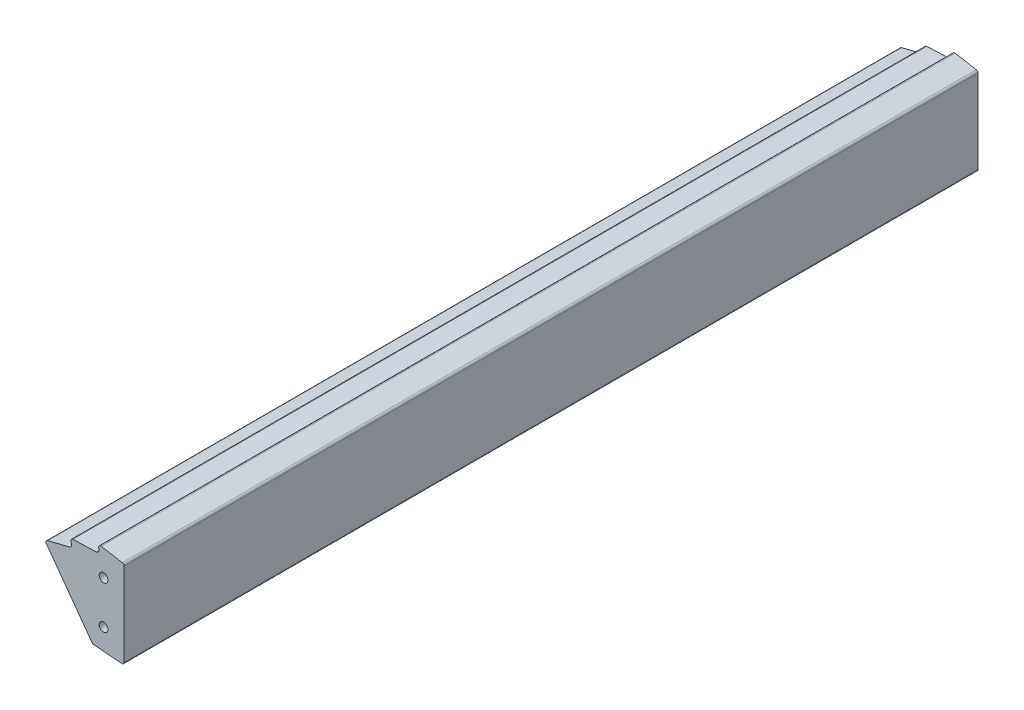
ISO-10303-21;
HEADER;
FILE_DESCRIPTION(('STEP AP214'),'2;1');
FILE_NAME('part.step','',(''),(''),'','','');
FILE_SCHEMA(('AUTOMOTIVE_DESIGN { 1 0 10303 214 1 1 1 1 }'));
ENDSEC;
DATA;
#1=APPLICATION_CONTEXT('core data for automotive mechanical design processes');
#2=APPLICATION_PROTOCOL_DEFINITION('international standard','automotive_design',2000,#1);
#3=PRODUCT_CONTEXT('',#1,'mechanical');
#4=PRODUCT('Part','Part','',(#3));
#5=PRODUCT_RELATED_PRODUCT_CATEGORY('part','',(#4));
#6=PRODUCT_DEFINITION_FORMATION('','',#4);
#7=PRODUCT_DEFINITION_CONTEXT('part definition',#1,'design');
#8=PRODUCT_DEFINITION('design','',#6,#7);
#9=PRODUCT_DEFINITION_SHAPE('','',#8);
#10=(LENGTH_UNIT() NAMED_UNIT(*) SI_UNIT(.MILLI.,.METRE.));
#11=(NAMED_UNIT(*) PLANE_ANGLE_UNIT() SI_UNIT($,.RADIAN.));
#12=(NAMED_UNIT(*) SI_UNIT($,.STERADIAN.) SOLID_ANGLE_UNIT());
#13=UNCERTAINTY_MEASURE_WITH_UNIT(LENGTH_MEASURE(1.E-05),#10,'distance_accuracy_value','');
#14=(GEOMETRIC_REPRESENTATION_CONTEXT(3) GLOBAL_UNCERTAINTY_ASSIGNED_CONTEXT((#13)) GLOBAL_UNIT_ASSIGNED_CONTEXT((#10,
#11,#12)) REPRESENTATION_CONTEXT('',''));
#15=CARTESIAN_POINT('',(0.,0.,0.));
#16=DIRECTION('',(0.,0.,1.));
#17=DIRECTION('',(1.,0.,0.));
#18=AXIS2_PLACEMENT_3D('',#15,#16,#17);
#19=CARTESIAN_POINT('',(-46.6812399998423,66.4118678141727,357.84012977767));
#20=DIRECTION('',(0.809016994374946,0.587785252292476,0.));
#21=DIRECTION('',(-0.587785252292476,0.809016994374946,0.));
#22=AXIS2_PLACEMENT_3D('',#19,#20,#21);
#23=PLANE('',#22);
#24=DIRECTION('',(0.587785252292476,-0.809016994374946,0.));
#25=VECTOR('',#24,1.);
#26=CARTESIAN_POINT('',(-46.6812399998423,66.4118678141727,212.000125));
#27=LINE('',#26,#25);
#28=CARTESIAN_POINT('',(-46.7307638488462,66.4800315445737,212.000125));
#29=VERTEX_POINT('',#28);
#30=CARTESIAN_POINT('',(-20.002598727479,29.6918683041559,212.000125));
#31=VERTEX_POINT('',#30);
#32=EDGE_CURVE('E439',#29,#31,#27,.T.);
#33=ORIENTED_EDGE('',*,*,#32,.F.);
#34=DIRECTION('',(0.,0.,-1.));
#35=VECTOR('',#34,1.);
#36=CARTESIAN_POINT('',(-46.7307638488462,66.4800315445737,357.84012977767));
#37=LINE('',#36,#35);
#38=CARTESIAN_POINT('',(-46.7307638488462,66.4800315445737,-287.999875));
#39=VERTEX_POINT('',#38);
#40=EDGE_CURVE('E441',#29,#39,#37,.T.);
#41=ORIENTED_EDGE('',*,*,#40,.T.);
#42=DIRECTION('',(-0.587785252292476,0.809016994374946,0.));
#43=VECTOR('',#42,1.);
#44=CARTESIAN_POINT('',(-46.6812399998423,66.4118678141727,-287.999875));
#45=LINE('',#44,#43);
#46=CARTESIAN_POINT('',(-20.002598727479,29.6918683041559,-287.999875));
#47=VERTEX_POINT('',#46);
#48=EDGE_CURVE('E243',#47,#39,#45,.T.);
#49=ORIENTED_EDGE('',*,*,#48,.F.);
#50=DIRECTION('',(0.,0.,-1.));
#51=VECTOR('',#50,1.);
#52=CARTESIAN_POINT('',(-20.002598727479,29.6918683041559,357.84012977767));
#53=LINE('',#52,#51);
#54=EDGE_CURVE('E442',#31,#47,#53,.T.);
#55=ORIENTED_EDGE('',*,*,#54,.F.);
#56=EDGE_LOOP('',(#33,#41,#49,#55));
#57=FACE_BOUND('',#56,.T.);
#58=ADVANCED_FACE('F229',(#57),#23,.F.);
#59=CARTESIAN_POINT('',(-19.0075078243978,30.4148441644756,357.84012977767));
#60=DIRECTION('',(0.,0.,-1.));
#61=DIRECTION('',(-1.,0.,0.));
#62=AXIS2_PLACEMENT_3D('',#59,#60,#61);
#63=CYLINDRICAL_SURFACE('',#62,1.23);
#64=CARTESIAN_POINT('',(-19.0075078243978,30.4148441644756,212.000125));
#65=DIRECTION('',(0.,0.,1.));
#66=DIRECTION('',(1.,0.,0.));
#67=AXIS2_PLACEMENT_3D('',#64,#65,#66);
#68=CIRCLE('',#67,1.23);
#69=CARTESIAN_POINT('',(-19.1053703077178,29.1887434612875,212.000125));
#70=VERTEX_POINT('',#69);
#71=EDGE_CURVE('E437',#31,#70,#68,.T.);
#72=ORIENTED_EDGE('',*,*,#71,.F.);
#73=ORIENTED_EDGE('',*,*,#54,.T.);
#74=CARTESIAN_POINT('',(-19.0075078243978,30.4148441644756,-287.999875));
#75=DIRECTION('',(0.,0.,-1.));
#76=DIRECTION('',(-1.,0.,0.));
#77=AXIS2_PLACEMENT_3D('',#74,#75,#76);
#78=CIRCLE('',#77,1.23);
#79=CARTESIAN_POINT('',(-19.1053703077178,29.1887434612875,-287.999875));
#80=VERTEX_POINT('',#79);
#81=EDGE_CURVE('E409',#80,#47,#78,.T.);
#82=ORIENTED_EDGE('',*,*,#81,.F.);
#83=DIRECTION('',(0.,0.,-1.));
#84=VECTOR('',#83,1.);
#85=CARTESIAN_POINT('',(-19.1053703077178,29.1887434612875,357.84012977767));
#86=LINE('',#85,#84);
#87=EDGE_CURVE('E445',#70,#80,#86,.T.);
#88=ORIENTED_EDGE('',*,*,#87,.F.);
#89=EDGE_LOOP('',(#72,#73,#82,#88));
#90=FACE_BOUND('',#89,.T.);
#91=ADVANCED_FACE('F505',(#90),#63,.T.);
#92=CARTESIAN_POINT('',(-19.1053703077178,29.1887434612875,357.84012977767));
#93=DIRECTION('',(0.0795629945691547,0.996829839990351,0.));
#94=DIRECTION('',(-0.996829839990351,0.0795629945691548,0.));
#95=AXIS2_PLACEMENT_3D('',#92,#93,#94);
#96=PLANE('',#95);
#97=DIRECTION('',(0.996829839990351,-0.0795629945691548,0.));
#98=VECTOR('',#97,1.);
#99=CARTESIAN_POINT('',(-19.1053703077178,29.1887434612875,212.000125));
#100=LINE('',#99,#98);
#101=CARTESIAN_POINT('',(-2.59786248331995,27.8711798183336,212.000125));
#102=VERTEX_POINT('',#101);
#103=EDGE_CURVE('E435',#70,#102,#100,.T.);
#104=ORIENTED_EDGE('',*,*,#103,.F.);
#105=ORIENTED_EDGE('',*,*,#87,.T.);
#106=DIRECTION('',(-0.996829839990351,0.0795629945691548,0.));
#107=VECTOR('',#106,1.);
#108=CARTESIAN_POINT('',(-19.1053703077178,29.1887434612875,-287.999875));
#109=LINE('',#108,#107);
#110=CARTESIAN_POINT('',(-2.59786248331995,27.8711798183336,-287.999875));
#111=VERTEX_POINT('',#110);
#112=EDGE_CURVE('E407',#111,#80,#109,.T.);
#113=ORIENTED_EDGE('',*,*,#112,.F.);
#114=DIRECTION('',(0.,0.,-1.));
#115=VECTOR('',#114,1.);
#116=CARTESIAN_POINT('',(-2.59786248331995,27.8711798183336,357.84012977767));
#117=LINE('',#116,#115);
#118=EDGE_CURVE('E448',#102,#111,#117,.T.);
#119=ORIENTED_EDGE('',*,*,#118,.F.);
#120=EDGE_LOOP('',(#104,#105,#113,#119));
#121=FACE_BOUND('',#120,.T.);
#122=ADVANCED_FACE('F511',(#121),#96,.F.);
#123=CARTESIAN_POINT('',(-2.49999999999989,29.0972805215217,357.84012977767));
#124=DIRECTION('',(0.,0.,-1.));
#125=DIRECTION('',(-1.,0.,0.));
#126=AXIS2_PLACEMENT_3D('',#123,#124,#125);
#127=CYLINDRICAL_SURFACE('',#126,1.23);
#128=CARTESIAN_POINT('',(-2.49999999999989,29.0972805215217,212.000125));
#129=DIRECTION('',(0.,0.,1.));
#130=DIRECTION('',(1.,0.,0.));
#131=AXIS2_PLACEMENT_3D('',#128,#129,#130);
#132=CIRCLE('',#131,1.23);
#133=CARTESIAN_POINT('',(-1.26999999999993,29.0972805215217,212.000125));
#134=VERTEX_POINT('',#133);
#135=EDGE_CURVE('E433',#102,#134,#132,.T.);
#136=ORIENTED_EDGE('',*,*,#135,.F.);
#137=ORIENTED_EDGE('',*,*,#118,.T.);
#138=CARTESIAN_POINT('',(-2.49999999999989,29.0972805215217,-287.999875));
#139=DIRECTION('',(0.,0.,-1.));
#140=DIRECTION('',(-1.,0.,0.));
#141=AXIS2_PLACEMENT_3D('',#138,#139,#140);
#142=CIRCLE('',#141,1.23);
#143=CARTESIAN_POINT('',(-1.26999999999993,29.0972805215217,-287.999875));
#144=VERTEX_POINT('',#143);
#145=EDGE_CURVE('E405',#144,#111,#142,.T.);
#146=ORIENTED_EDGE('',*,*,#145,.F.);
#147=DIRECTION('',(0.,0.,-1.));
#148=VECTOR('',#147,1.);
#149=CARTESIAN_POINT('',(-1.26999999999989,29.0972805215217,357.84012977767));
#150=LINE('',#149,#148);
#151=EDGE_CURVE('E451',#134,#144,#150,.T.);
#152=ORIENTED_EDGE('',*,*,#151,.F.);
#153=EDGE_LOOP('',(#136,#137,#146,#152));
#154=FACE_BOUND('',#153,.T.);
#155=ADVANCED_FACE('F515',(#154),#127,.T.);
#156=CARTESIAN_POINT('',(-1.27,77.9504927164239,357.84012977767));
#157=DIRECTION('',(-1.,0.,0.));
#158=DIRECTION('',(0.,-1.,0.));
#159=AXIS2_PLACEMENT_3D('',#156,#157,#158);
#160=PLANE('',#159);
#161=DIRECTION('',(0.,1.,0.));
#162=VECTOR('',#161,1.);
#163=CARTESIAN_POINT('',(-1.27,77.9504927164239,212.000125));
#164=LINE('',#163,#162);
#165=CARTESIAN_POINT('',(-1.27,77.9504927164239,212.000125));
#166=VERTEX_POINT('',#165);
#167=EDGE_CURVE('E431',#134,#166,#164,.T.);
#168=ORIENTED_EDGE('',*,*,#167,.F.);
#169=ORIENTED_EDGE('',*,*,#151,.T.);
#170=DIRECTION('',(0.,-1.,0.));
#171=VECTOR('',#170,1.);
#172=CARTESIAN_POINT('',(-1.27,77.9504927164239,-287.999875));
#173=LINE('',#172,#171);
#174=CARTESIAN_POINT('',(-1.27,77.9504927164239,-287.999875));
#175=VERTEX_POINT('',#174);
#176=EDGE_CURVE('E403',#175,#144,#173,.T.);
#177=ORIENTED_EDGE('',*,*,#176,.F.);
#178=DIRECTION('',(0.,0.,-1.));
#179=VECTOR('',#178,1.);
#180=CARTESIAN_POINT('',(-1.27,77.9504927164239,357.84012977767));
#181=LINE('',#180,#179);
#182=EDGE_CURVE('E454',#166,#175,#181,.T.);
#183=ORIENTED_EDGE('',*,*,#182,.F.);
#184=EDGE_LOOP('',(#168,#169,#177,#183));
#185=FACE_BOUND('',#184,.T.);
#186=ADVANCED_FACE('F521',(#185),#160,.F.);
#187=CARTESIAN_POINT('',(-2.47361650036875,77.9504927164239,357.84012977767));
#188=DIRECTION('',(0.,0.,-1.));
#189=DIRECTION('',(-1.,0.,0.));
#190=AXIS2_PLACEMENT_3D('',#187,#188,#189);
#191=CYLINDRICAL_SURFACE('',#190,1.20361650036875);
#192=CARTESIAN_POINT('',(-2.47361650036875,77.9504927164239,212.000125));
#193=DIRECTION('',(0.,0.,1.));
#194=DIRECTION('',(1.,0.,0.));
#195=AXIS2_PLACEMENT_3D('',#192,#193,#194);
#196=CIRCLE('',#195,1.20361650036875);
#197=CARTESIAN_POINT('',(-2.26384716902907,79.1356886949816,212.000125));
#198=VERTEX_POINT('',#197);
#199=EDGE_CURVE('E429',#166,#198,#196,.T.);
#200=ORIENTED_EDGE('',*,*,#199,.F.);
#201=ORIENTED_EDGE('',*,*,#182,.T.);
#202=CARTESIAN_POINT('',(-2.47361650036875,77.9504927164239,-287.999875));
#203=DIRECTION('',(0.,0.,-1.));
#204=DIRECTION('',(-1.,0.,0.));
#205=AXIS2_PLACEMENT_3D('',#202,#203,#204);
#206=CIRCLE('',#205,1.20361650036875);
#207=CARTESIAN_POINT('',(-2.26384716902907,79.1356886949816,-287.999875));
#208=VERTEX_POINT('',#207);
#209=EDGE_CURVE('E401',#208,#175,#206,.T.);
#210=ORIENTED_EDGE('',*,*,#209,.F.);
#211=DIRECTION('',(0.,0.,-1.));
#212=VECTOR('',#211,1.);
#213=CARTESIAN_POINT('',(-2.26384716902907,79.1356886949816,357.84012977767));
#214=LINE('',#213,#212);
#215=EDGE_CURVE('E457',#198,#208,#214,.T.);
#216=ORIENTED_EDGE('',*,*,#215,.F.);
#217=EDGE_LOOP('',(#200,#201,#210,#216));
#218=FACE_BOUND('',#217,.T.);
#219=ADVANCED_FACE('F525',(#218),#191,.T.);
#220=CARTESIAN_POINT('',(-2.26384716902907,79.1356886949816,357.84012977767));
#221=DIRECTION('',(-0.174282532081782,-0.984695688530808,0.));
#222=DIRECTION('',(0.984695688530808,-0.174282532081782,0.));
#223=AXIS2_PLACEMENT_3D('',#220,#221,#222);
#224=PLANE('',#223);
#225=DIRECTION('',(-0.984695688530808,0.174282532081782,0.));
#226=VECTOR('',#225,1.);
#227=CARTESIAN_POINT('',(-2.26384716902907,79.1356886949816,212.000125));
#228=LINE('',#227,#226);
#229=CARTESIAN_POINT('',(-14.5839741894198,81.3162435178493,212.000125));
#230=VERTEX_POINT('',#229);
#231=EDGE_CURVE('E427',#198,#230,#228,.T.);
#232=ORIENTED_EDGE('',*,*,#231,.F.);
#233=ORIENTED_EDGE('',*,*,#215,.T.);
#234=DIRECTION('',(0.984695688530808,-0.174282532081782,0.));
#235=VECTOR('',#234,1.);
#236=CARTESIAN_POINT('',(-2.26384716902907,79.1356886949816,-287.999875));
#237=LINE('',#236,#235);
#238=CARTESIAN_POINT('',(-14.5839741894198,81.3162435178493,-287.999875));
#239=VERTEX_POINT('',#238);
#240=EDGE_CURVE('E399',#239,#208,#237,.T.);
#241=ORIENTED_EDGE('',*,*,#240,.F.);
#242=DIRECTION('',(0.,0.,-1.));
#243=VECTOR('',#242,1.);
#244=CARTESIAN_POINT('',(-14.5839741894198,81.3162435178493,357.84012977767));
#245=LINE('',#244,#243);
#246=EDGE_CURVE('E460',#230,#239,#245,.T.);
#247=ORIENTED_EDGE('',*,*,#246,.F.);
#248=EDGE_LOOP('',(#232,#233,#241,#247));
#249=FACE_BOUND('',#248,.T.);
#250=ADVANCED_FACE('F531',(#249),#224,.F.);
#251=CARTESIAN_POINT('',(-14.8201270203906,79.9819808598901,357.84012977767));
#252=DIRECTION('',(0.,0.,-1.));
#253=DIRECTION('',(-1.,0.,0.));
#254=AXIS2_PLACEMENT_3D('',#251,#252,#253);
#255=CYLINDRICAL_SURFACE('',#254,1.35499999999996);
#256=CARTESIAN_POINT('',(-14.8201270203906,79.9819808598901,212.000125));
#257=DIRECTION('',(0.,0.,1.));
#258=DIRECTION('',(1.,0.,0.));
#259=AXIS2_PLACEMENT_3D('',#256,#257,#258);
#260=CIRCLE('',#259,1.35499999999996);
#261=CARTESIAN_POINT('',(-16.1476694198166,79.7105841433912,212.000125));
#262=VERTEX_POINT('',#261);
#263=EDGE_CURVE('E425',#230,#262,#260,.T.);
#264=ORIENTED_EDGE('',*,*,#263,.F.);
#265=ORIENTED_EDGE('',*,*,#246,.T.);
#266=CARTESIAN_POINT('',(-14.8201270203906,79.9819808598901,-287.999875));
#267=DIRECTION('',(0.,0.,-1.));
#268=DIRECTION('',(-1.,0.,0.));
#269=AXIS2_PLACEMENT_3D('',#266,#267,#268);
#270=CIRCLE('',#269,1.35499999999996);
#271=CARTESIAN_POINT('',(-16.1476694198166,79.7105841433912,-287.999875));
#272=VERTEX_POINT('',#271);
#273=EDGE_CURVE('E397',#272,#239,#270,.T.);
#274=ORIENTED_EDGE('',*,*,#273,.F.);
#275=DIRECTION('',(0.,0.,-1.));
#276=VECTOR('',#275,1.);
#277=CARTESIAN_POINT('',(-16.1476694198166,79.7105841433912,357.84012977767));
#278=LINE('',#277,#276);
#279=EDGE_CURVE('E463',#262,#272,#278,.T.);
#280=ORIENTED_EDGE('',*,*,#279,.F.);
#281=EDGE_LOOP('',(#264,#265,#274,#280));
#282=FACE_BOUND('',#281,.T.);
#283=ADVANCED_FACE('F535',(#282),#255,.T.);
#284=CARTESIAN_POINT('',(-16.1476694198166,79.7105841433912,357.84012977767));
#285=DIRECTION('',(0.979736088137251,0.200292779703905,0.));
#286=DIRECTION('',(-0.200292779703905,0.979736088137251,0.));
#287=AXIS2_PLACEMENT_3D('',#284,#285,#286);
#288=PLANE('',#287);
#289=DIRECTION('',(0.200292779703905,-0.979736088137251,0.));
#290=VECTOR('',#289,1.);
#291=CARTESIAN_POINT('',(-16.1476694198166,79.7105841433912,212.000125));
#292=LINE('',#291,#290);
#293=CARTESIAN_POINT('',(-15.9916944421656,78.9476294593685,212.000125));
#294=VERTEX_POINT('',#293);
#295=EDGE_CURVE('E423',#262,#294,#292,.T.);
#296=ORIENTED_EDGE('',*,*,#295,.F.);
#297=ORIENTED_EDGE('',*,*,#279,.T.);
#298=DIRECTION('',(-0.200292779703905,0.979736088137251,0.));
#299=VECTOR('',#298,1.);
#300=CARTESIAN_POINT('',(-16.1476694198166,79.7105841433912,-287.999875));
#301=LINE('',#300,#299);
#302=CARTESIAN_POINT('',(-15.9916944421656,78.9476294593685,-287.999875));
#303=VERTEX_POINT('',#302);
#304=EDGE_CURVE('E395',#303,#272,#301,.T.);
#305=ORIENTED_EDGE('',*,*,#304,.F.);
#306=DIRECTION('',(0.,0.,-1.));
#307=VECTOR('',#306,1.);
#308=CARTESIAN_POINT('',(-15.9916944421656,78.9476294593685,357.84012977767));
#309=LINE('',#308,#307);
#310=EDGE_CURVE('E466',#294,#303,#309,.T.);
#311=ORIENTED_EDGE('',*,*,#310,.F.);
#312=EDGE_LOOP('',(#296,#297,#305,#311));
#313=FACE_BOUND('',#312,.T.);
#314=ADVANCED_FACE('F541',(#313),#288,.F.);
#315=CARTESIAN_POINT('',(-17.6033603071514,78.6181478367555,357.84012977767));
#316=DIRECTION('',(0.,0.,-1.));
#317=DIRECTION('',(-1.,0.,0.));
#318=AXIS2_PLACEMENT_3D('',#315,#316,#317);
#319=CYLINDRICAL_SURFACE('',#318,1.645);
#320=CARTESIAN_POINT('',(-17.6033603071514,78.6181478367555,212.000125));
#321=DIRECTION('',(0.,0.,1.));
#322=DIRECTION('',(1.,0.,0.));
#323=AXIS2_PLACEMENT_3D('',#320,#321,#322);
#324=CIRCLE('',#323,1.645);
#325=CARTESIAN_POINT('',(-17.547009672529,76.9741132854222,212.000125));
#326=VERTEX_POINT('',#325);
#327=EDGE_CURVE('E421',#294,#326,#324,.F.);
#328=ORIENTED_EDGE('',*,*,#327,.F.);
#329=ORIENTED_EDGE('',*,*,#310,.T.);
#330=CARTESIAN_POINT('',(-17.6033603071514,78.6181478367555,-287.999875));
#331=DIRECTION('',(0.,0.,-1.));
#332=DIRECTION('',(-1.,0.,0.));
#333=AXIS2_PLACEMENT_3D('',#330,#331,#332);
#334=CIRCLE('',#333,1.645);
#335=CARTESIAN_POINT('',(-17.547009672529,76.9741132854222,-287.999875));
#336=VERTEX_POINT('',#335);
#337=EDGE_CURVE('E393',#336,#303,#334,.F.);
#338=ORIENTED_EDGE('',*,*,#337,.F.);
#339=DIRECTION('',(0.,0.,-1.));
#340=VECTOR('',#339,1.);
#341=CARTESIAN_POINT('',(-17.547009672529,76.9741132854222,357.84012977767));
#342=LINE('',#341,#340);
#343=EDGE_CURVE('E469',#326,#336,#342,.T.);
#344=ORIENTED_EDGE('',*,*,#343,.F.);
#345=EDGE_LOOP('',(#328,#329,#338,#344));
#346=FACE_BOUND('',#345,.T.);
#347=ADVANCED_FACE('F545',(#346),#319,.F.);
#348=CARTESIAN_POINT('',(-17.547009672529,76.9741132854222,357.84012977767));
#349=DIRECTION('',(0.0342557049376549,-0.999413101114461,0.));
#350=DIRECTION('',(0.999413101114461,0.0342557049376549,0.));
#351=AXIS2_PLACEMENT_3D('',#348,#349,#350);
#352=PLANE('',#351);
#353=DIRECTION('',(-0.999413101114461,-0.0342557049376549,0.));
#354=VECTOR('',#353,1.);
#355=CARTESIAN_POINT('',(-17.547009672529,76.9741132854222,212.000125));
#356=LINE('',#355,#354);
#357=CARTESIAN_POINT('',(-31.171877043291,76.5071097651091,212.000125));
#358=VERTEX_POINT('',#357);
#359=EDGE_CURVE('E419',#326,#358,#356,.T.);
#360=ORIENTED_EDGE('',*,*,#359,.F.);
#361=ORIENTED_EDGE('',*,*,#343,.T.);
#362=DIRECTION('',(0.999413101114461,0.0342557049376549,0.));
#363=VECTOR('',#362,1.);
#364=CARTESIAN_POINT('',(-17.547009672529,76.9741132854222,-287.999875));
#365=LINE('',#364,#363);
#366=CARTESIAN_POINT('',(-31.171877043291,76.5071097651091,-287.999875));
#367=VERTEX_POINT('',#366);
#368=EDGE_CURVE('E391',#367,#336,#365,.T.);
#369=ORIENTED_EDGE('',*,*,#368,.F.);
#370=DIRECTION('',(0.,0.,-1.));
#371=VECTOR('',#370,1.);
#372=CARTESIAN_POINT('',(-31.171877043291,76.5071097651091,357.84012977767));
#373=LINE('',#372,#371);
#374=EDGE_CURVE('E472',#358,#367,#373,.T.);
#375=ORIENTED_EDGE('',*,*,#374,.F.);
#376=EDGE_LOOP('',(#360,#361,#369,#375));
#377=FACE_BOUND('',#376,.T.);
#378=ADVANCED_FACE('F551',(#377),#352,.F.);
#379=CARTESIAN_POINT('',(-31.1254605631004,75.152905013099,357.84012977767));
#380=DIRECTION('',(0.,0.,-1.));
#381=DIRECTION('',(-1.,0.,0.));
#382=AXIS2_PLACEMENT_3D('',#379,#380,#381);
#383=CYLINDRICAL_SURFACE('',#382,1.355);
#384=CARTESIAN_POINT('',(-31.1254605631004,75.152905013099,212.000125));
#385=DIRECTION('',(0.,0.,1.));
#386=DIRECTION('',(1.,0.,0.));
#387=AXIS2_PLACEMENT_3D('',#384,#385,#386);
#388=CIRCLE('',#387,1.355);
#389=CARTESIAN_POINT('',(-32.3675664257617,74.6114273811117,212.000125));
#390=VERTEX_POINT('',#389);
#391=EDGE_CURVE('E417',#358,#390,#388,.T.);
#392=ORIENTED_EDGE('',*,*,#391,.F.);
#393=ORIENTED_EDGE('',*,*,#374,.T.);
#394=CARTESIAN_POINT('',(-31.1254605631004,75.152905013099,-287.999875));
#395=DIRECTION('',(0.,0.,-1.));
#396=DIRECTION('',(-1.,0.,0.));
#397=AXIS2_PLACEMENT_3D('',#394,#395,#396);
#398=CIRCLE('',#397,1.355);
#399=CARTESIAN_POINT('',(-32.3675664257617,74.6114273811117,-287.999875));
#400=VERTEX_POINT('',#399);
#401=EDGE_CURVE('E389',#400,#367,#398,.T.);
#402=ORIENTED_EDGE('',*,*,#401,.F.);
#403=DIRECTION('',(0.,0.,-1.));
#404=VECTOR('',#403,1.);
#405=CARTESIAN_POINT('',(-32.3675664257617,74.6114273811117,357.84012977767));
#406=LINE('',#405,#404);
#407=EDGE_CURVE('E475',#390,#400,#406,.T.);
#408=ORIENTED_EDGE('',*,*,#407,.F.);
#409=EDGE_LOOP('',(#392,#393,#402,#408));
#410=FACE_BOUND('',#409,.T.);
#411=ADVANCED_FACE('F555',(#410),#383,.T.);
#412=CARTESIAN_POINT('',(-32.3675664257617,74.6114273811117,357.84012977767));
#413=DIRECTION('',(0.916683293476938,0.399614488551497,0.));
#414=DIRECTION('',(-0.399614488551497,0.916683293476938,0.));
#415=AXIS2_PLACEMENT_3D('',#412,#413,#414);
#416=PLANE('',#415);
#417=DIRECTION('',(0.399614488551497,-0.916683293476938,0.));
#418=VECTOR('',#417,1.);
#419=CARTESIAN_POINT('',(-32.3675664257617,74.6114273811117,212.000125));
#420=LINE('',#419,#418);
#421=CARTESIAN_POINT('',(-32.0563726772242,73.8975741087921,212.000125));
#422=VERTEX_POINT('',#421);
#423=EDGE_CURVE('E415',#390,#422,#420,.T.);
#424=ORIENTED_EDGE('',*,*,#423,.F.);
#425=ORIENTED_EDGE('',*,*,#407,.T.);
#426=DIRECTION('',(-0.399614488551497,0.916683293476938,0.));
#427=VECTOR('',#426,1.);
#428=CARTESIAN_POINT('',(-32.3675664257617,74.6114273811117,-287.999875));
#429=LINE('',#428,#427);
#430=CARTESIAN_POINT('',(-32.0563726772242,73.8975741087921,-287.999875));
#431=VERTEX_POINT('',#430);
#432=EDGE_CURVE('E387',#431,#400,#429,.T.);
#433=ORIENTED_EDGE('',*,*,#432,.F.);
#434=DIRECTION('',(0.,0.,-1.));
#435=VECTOR('',#434,1.);
#436=CARTESIAN_POINT('',(-32.0563726772242,73.8975741087921,357.84012977767));
#437=LINE('',#436,#435);
#438=EDGE_CURVE('E478',#422,#431,#437,.T.);
#439=ORIENTED_EDGE('',*,*,#438,.F.);
#440=EDGE_LOOP('',(#424,#425,#433,#439));
#441=FACE_BOUND('',#440,.T.);
#442=ADVANCED_FACE('F561',(#441),#416,.F.);
#443=CARTESIAN_POINT('',(-33.5643166949937,73.2402082751248,357.84012977767));
#444=DIRECTION('',(0.,0.,-1.));
#445=DIRECTION('',(-1.,0.,0.));
#446=AXIS2_PLACEMENT_3D('',#443,#444,#445);
#447=CYLINDRICAL_SURFACE('',#446,1.645);
#448=CARTESIAN_POINT('',(-33.5643166949937,73.2402082751248,212.000125));
#449=DIRECTION('',(0.,0.,1.));
#450=DIRECTION('',(1.,0.,0.));
#451=AXIS2_PLACEMENT_3D('',#448,#449,#450);
#452=CIRCLE('',#451,1.645);
#453=CARTESIAN_POINT('',(-33.1673834536075,71.6438157789377,212.000125));
#454=VERTEX_POINT('',#453);
#455=EDGE_CURVE('E413',#422,#454,#452,.F.);
#456=ORIENTED_EDGE('',*,*,#455,.F.);
#457=ORIENTED_EDGE('',*,*,#438,.T.);
#458=CARTESIAN_POINT('',(-33.5643166949937,73.2402082751248,-287.999875));
#459=DIRECTION('',(0.,0.,-1.));
#460=DIRECTION('',(-1.,0.,0.));
#461=AXIS2_PLACEMENT_3D('',#458,#459,#460);
#462=CIRCLE('',#461,1.645);
#463=CARTESIAN_POINT('',(-33.1673834536075,71.6438157789377,-287.999875));
#464=VERTEX_POINT('',#463);
#465=EDGE_CURVE('E385',#464,#431,#462,.F.);
#466=ORIENTED_EDGE('',*,*,#465,.F.);
#467=DIRECTION('',(0.,0.,-1.));
#468=VECTOR('',#467,1.);
#469=CARTESIAN_POINT('',(-33.1673834536075,71.6438157789377,357.84012977767));
#470=LINE('',#469,#468);
#471=EDGE_CURVE('E481',#454,#464,#470,.T.);
#472=ORIENTED_EDGE('',*,*,#471,.F.);
#473=EDGE_LOOP('',(#456,#457,#466,#472));
#474=FACE_BOUND('',#473,.T.);
#475=ADVANCED_FACE('F564',(#474),#447,.F.);
#476=CARTESIAN_POINT('',(-33.1673834536075,71.6438157789377,357.84012977767));
#477=DIRECTION('',(0.241296803274277,-0.970451365463316,0.));
#478=DIRECTION('',(0.970451365463316,0.241296803274277,0.));
#479=AXIS2_PLACEMENT_3D('',#476,#477,#478);
#480=PLANE('',#479);
#481=DIRECTION('',(-0.970451365463316,-0.241296803274277,0.));
#482=VECTOR('',#481,1.);
#483=CARTESIAN_POINT('',(-33.1673834536075,71.6438157789377,212.000125));
#484=LINE('',#483,#482);
#485=CARTESIAN_POINT('',(-46.0131062683442,68.4498052790261,212.000125));
#486=VERTEX_POINT('',#485);
#487=EDGE_CURVE('E250',#454,#486,#484,.T.);
#488=ORIENTED_EDGE('',*,*,#487,.F.);
#489=ORIENTED_EDGE('',*,*,#471,.T.);
#490=DIRECTION('',(0.970451365463316,0.241296803274277,0.));
#491=VECTOR('',#490,1.);
#492=CARTESIAN_POINT('',(-33.1673834536075,71.6438157789377,-287.999875));
#493=LINE('',#492,#491);
#494=CARTESIAN_POINT('',(-46.0131062683442,68.4498052790261,-287.999875));
#495=VERTEX_POINT('',#494);
#496=EDGE_CURVE('E383',#495,#464,#493,.T.);
#497=ORIENTED_EDGE('',*,*,#496,.F.);
#498=DIRECTION('',(0.,0.,-1.));
#499=VECTOR('',#498,1.);
#500=CARTESIAN_POINT('',(-46.0131062683442,68.4498052790261,357.84012977767));
#501=LINE('',#500,#499);
#502=EDGE_CURVE('E484',#486,#495,#501,.T.);
#503=ORIENTED_EDGE('',*,*,#502,.F.);
#504=EDGE_LOOP('',(#488,#489,#497,#503));
#505=FACE_BOUND('',#504,.T.);
#506=ADVANCED_FACE('F495',(#505),#480,.F.);
#507=CARTESIAN_POINT('',(-45.7080819223103,67.2230534568246,357.84012977767));
#508=DIRECTION('',(0.,0.,-1.));
#509=DIRECTION('',(-1.,0.,0.));
#510=AXIS2_PLACEMENT_3D('',#507,#508,#509);
#511=CYLINDRICAL_SURFACE('',#510,1.26410438055887);
#512=ORIENTED_EDGE('',*,*,#40,.F.);
#513=CARTESIAN_POINT('',(-45.7080819223103,67.2230534568246,212.000125));
#514=DIRECTION('',(0.,0.,1.));
#515=DIRECTION('',(1.,0.,0.));
#516=AXIS2_PLACEMENT_3D('',#513,#514,#515);
#517=CIRCLE('',#516,1.26410438055887);
#518=EDGE_CURVE('E13',#486,#29,#517,.T.);
#519=ORIENTED_EDGE('',*,*,#518,.F.);
#520=ORIENTED_EDGE('',*,*,#502,.T.);
#521=CARTESIAN_POINT('',(-45.7080819223103,67.2230534568246,-287.999875));
#522=DIRECTION('',(0.,0.,-1.));
#523=DIRECTION('',(-1.,0.,0.));
#524=AXIS2_PLACEMENT_3D('',#521,#522,#523);
#525=CIRCLE('',#524,1.26410438055887);
#526=EDGE_CURVE('E236',#39,#495,#525,.T.);
#527=ORIENTED_EDGE('',*,*,#526,.F.);
#528=EDGE_LOOP('',(#512,#519,#520,#527));
#529=FACE_BOUND('',#528,.T.);
#530=ADVANCED_FACE('F497',(#529),#511,.T.);
#531=CARTESIAN_POINT('',(-46.9721863028692,103.523886616455,-287.999875));
#532=DIRECTION('',(0.,0.,-1.));
#533=DIRECTION('',(-1.,0.,0.));
#534=AXIS2_PLACEMENT_3D('',#531,#532,#533);
#535=PLANE('',#534);
#536=CARTESIAN_POINT('',(-13.2699999999999,66.0238866164554,-287.999875));
#537=DIRECTION('',(0.,0.,-1.));
#538=DIRECTION('',(-1.,0.,0.));
#539=AXIS2_PLACEMENT_3D('',#536,#537,#538);
#540=CIRCLE('',#539,2.5527);
#541=CARTESIAN_POINT('',(-15.8226999999999,66.0238866164554,-287.999875));
#542=VERTEX_POINT('',#541);
#543=EDGE_CURVE('E371',#542,#542,#540,.T.);
#544=ORIENTED_EDGE('',*,*,#543,.F.);
#545=EDGE_LOOP('',(#544));
#546=FACE_BOUND('',#545,.T.);
#547=CARTESIAN_POINT('',(-13.2699999999999,41.0238866164554,-287.999875));
#548=DIRECTION('',(0.,0.,-1.));
#549=DIRECTION('',(-1.,0.,0.));
#550=AXIS2_PLACEMENT_3D('',#547,#548,#549);
#551=CIRCLE('',#550,2.5527);
#552=CARTESIAN_POINT('',(-15.8226999999999,41.0238866164554,-287.999875));
#553=VERTEX_POINT('',#552);
#554=EDGE_CURVE('E377',#553,#553,#551,.T.);
#555=ORIENTED_EDGE('',*,*,#554,.F.);
#556=EDGE_LOOP('',(#555));
#557=FACE_BOUND('',#556,.T.);
#558=ORIENTED_EDGE('',*,*,#48,.T.);
#559=ORIENTED_EDGE('',*,*,#526,.T.);
#560=ORIENTED_EDGE('',*,*,#496,.T.);
#561=ORIENTED_EDGE('',*,*,#465,.T.);
#562=ORIENTED_EDGE('',*,*,#432,.T.);
#563=ORIENTED_EDGE('',*,*,#401,.T.);
#564=ORIENTED_EDGE('',*,*,#368,.T.);
#565=ORIENTED_EDGE('',*,*,#337,.T.);
#566=ORIENTED_EDGE('',*,*,#304,.T.);
#567=ORIENTED_EDGE('',*,*,#273,.T.);
#568=ORIENTED_EDGE('',*,*,#240,.T.);
#569=ORIENTED_EDGE('',*,*,#209,.T.);
#570=ORIENTED_EDGE('',*,*,#176,.T.);
#571=ORIENTED_EDGE('',*,*,#145,.T.);
#572=ORIENTED_EDGE('',*,*,#112,.T.);
#573=ORIENTED_EDGE('',*,*,#81,.T.);
#574=EDGE_LOOP('',(#558,#559,#560,#561,#562,#563,#564,#565,#566,#567,#568,#569,#570,#571,#572,#573));
#575=FACE_BOUND('',#574,.T.);
#576=ADVANCED_FACE('F489',(#546,#557,#575),#535,.T.);
#577=CARTESIAN_POINT('',(-46.9721863028692,103.523886616455,212.000125));
#578=DIRECTION('',(0.,0.,1.));
#579=DIRECTION('',(1.,0.,0.));
#580=AXIS2_PLACEMENT_3D('',#577,#578,#579);
#581=PLANE('',#580);
#582=CARTESIAN_POINT('',(-13.2699999999999,66.0238866164554,212.000125));
#583=DIRECTION('',(0.,0.,1.));
#584=DIRECTION('',(1.,0.,0.));
#585=AXIS2_PLACEMENT_3D('',#582,#583,#584);
#586=CIRCLE('',#585,2.5527);
#587=CARTESIAN_POINT('',(-10.7172999999999,66.0238866164554,212.000125));
#588=VERTEX_POINT('',#587);
#589=EDGE_CURVE('E361',#588,#588,#586,.T.);
#590=ORIENTED_EDGE('',*,*,#589,.F.);
#591=EDGE_LOOP('',(#590));
#592=FACE_BOUND('',#591,.T.);
#593=CARTESIAN_POINT('',(-13.2699999999999,41.0238866164555,212.000125));
#594=DIRECTION('',(0.,0.,1.));
#595=DIRECTION('',(1.,0.,0.));
#596=AXIS2_PLACEMENT_3D('',#593,#594,#595);
#597=CIRCLE('',#596,2.5527);
#598=CARTESIAN_POINT('',(-10.7172999999999,41.0238866164555,212.000125));
#599=VERTEX_POINT('',#598);
#600=EDGE_CURVE('E360',#599,#599,#597,.T.);
#601=ORIENTED_EDGE('',*,*,#600,.F.);
#602=EDGE_LOOP('',(#601));
#603=FACE_BOUND('',#602,.T.);
#604=ORIENTED_EDGE('',*,*,#32,.T.);
#605=ORIENTED_EDGE('',*,*,#71,.T.);
#606=ORIENTED_EDGE('',*,*,#103,.T.);
#607=ORIENTED_EDGE('',*,*,#135,.T.);
#608=ORIENTED_EDGE('',*,*,#167,.T.);
#609=ORIENTED_EDGE('',*,*,#199,.T.);
#610=ORIENTED_EDGE('',*,*,#231,.T.);
#611=ORIENTED_EDGE('',*,*,#263,.T.);
#612=ORIENTED_EDGE('',*,*,#295,.T.);
#613=ORIENTED_EDGE('',*,*,#327,.T.);
#614=ORIENTED_EDGE('',*,*,#359,.T.);
#615=ORIENTED_EDGE('',*,*,#391,.T.);
#616=ORIENTED_EDGE('',*,*,#423,.T.);
#617=ORIENTED_EDGE('',*,*,#455,.T.);
#618=ORIENTED_EDGE('',*,*,#487,.T.);
#619=ORIENTED_EDGE('',*,*,#518,.T.);
#620=EDGE_LOOP('',(#604,#605,#606,#607,#608,#609,#610,#611,#612,#613,#614,#615,#616,#617,#618,#619));
#621=FACE_BOUND('',#620,.T.);
#622=ADVANCED_FACE('F499',(#592,#603,#621),#581,.T.);
#623=CARTESIAN_POINT('',(-13.2699999999999,41.0238866164554,-271.489875));
#624=DIRECTION('',(0.,0.,-1.));
#625=DIRECTION('',(-1.,0.,0.));
#626=AXIS2_PLACEMENT_3D('',#623,#624,#625);
#627=CONICAL_SURFACE('',#626,2.5527,1.02974425867666);
#628=CARTESIAN_POINT('',(-13.2699999999999,41.0238866164554,-269.956058097808));
#629=VERTEX_POINT('',#628);
#630=VERTEX_LOOP('',#629);
#631=FACE_BOUND('',#630,.T.);
#632=CARTESIAN_POINT('',(-13.2699999999999,41.0238866164554,-271.489875));
#633=DIRECTION('',(0.,0.,-1.));
#634=DIRECTION('',(-1.,0.,0.));
#635=AXIS2_PLACEMENT_3D('',#632,#633,#634);
#636=CIRCLE('',#635,2.5527);
#637=CARTESIAN_POINT('',(-15.8226999999999,41.0238866164554,-271.489875));
#638=VERTEX_POINT('',#637);
#639=EDGE_CURVE('E380',#638,#638,#636,.T.);
#640=ORIENTED_EDGE('',*,*,#639,.T.);
#641=EDGE_LOOP('',(#640));
#642=FACE_BOUND('',#641,.T.);
#643=ADVANCED_FACE('F644',(#631,#642),#627,.F.);
#644=CARTESIAN_POINT('',(-13.2699999999999,41.0238866164554,-287.999875));
#645=DIRECTION('',(0.,0.,-1.));
#646=DIRECTION('',(-1.,0.,0.));
#647=AXIS2_PLACEMENT_3D('',#644,#645,#646);
#648=CYLINDRICAL_SURFACE('',#647,2.5527);
#649=ORIENTED_EDGE('',*,*,#639,.F.);
#650=EDGE_LOOP('',(#649));
#651=FACE_BOUND('',#650,.T.);
#652=ORIENTED_EDGE('',*,*,#554,.T.);
#653=EDGE_LOOP('',(#652));
#654=FACE_BOUND('',#653,.T.);
#655=ADVANCED_FACE('F654',(#651,#654),#648,.F.);
#656=CARTESIAN_POINT('',(-13.2699999999999,66.0238866164554,-271.489875));
#657=DIRECTION('',(0.,0.,-1.));
#658=DIRECTION('',(-1.,0.,0.));
#659=AXIS2_PLACEMENT_3D('',#656,#657,#658);
#660=CONICAL_SURFACE('',#659,2.5527,1.02974425867666);
#661=CARTESIAN_POINT('',(-13.2699999999999,66.0238866164554,-269.956058097808));
#662=VERTEX_POINT('',#661);
#663=VERTEX_LOOP('',#662);
#664=FACE_BOUND('',#663,.T.);
#665=CARTESIAN_POINT('',(-13.2699999999999,66.0238866164554,-271.489875));
#666=DIRECTION('',(0.,0.,-1.));
#667=DIRECTION('',(-1.,0.,0.));
#668=AXIS2_PLACEMENT_3D('',#665,#666,#667);
#669=CIRCLE('',#668,2.5527);
#670=CARTESIAN_POINT('',(-15.8226999999999,66.0238866164554,-271.489875));
#671=VERTEX_POINT('',#670);
#672=EDGE_CURVE('E374',#671,#671,#669,.T.);
#673=ORIENTED_EDGE('',*,*,#672,.T.);
#674=EDGE_LOOP('',(#673));
#675=FACE_BOUND('',#674,.T.);
#676=ADVANCED_FACE('F666',(#664,#675),#660,.F.);
#677=CARTESIAN_POINT('',(-13.2699999999999,66.0238866164554,-287.999875));
#678=DIRECTION('',(0.,0.,-1.));
#679=DIRECTION('',(-1.,0.,0.));
#680=AXIS2_PLACEMENT_3D('',#677,#678,#679);
#681=CYLINDRICAL_SURFACE('',#680,2.5527);
#682=ORIENTED_EDGE('',*,*,#672,.F.);
#683=EDGE_LOOP('',(#682));
#684=FACE_BOUND('',#683,.T.);
#685=ORIENTED_EDGE('',*,*,#543,.T.);
#686=EDGE_LOOP('',(#685));
#687=FACE_BOUND('',#686,.T.);
#688=ADVANCED_FACE('F677',(#684,#687),#681,.F.);
#689=CARTESIAN_POINT('',(-13.2699999999999,41.0238866164555,195.490125));
#690=DIRECTION('',(0.,0.,1.));
#691=DIRECTION('',(1.,0.,0.));
#692=AXIS2_PLACEMENT_3D('',#689,#690,#691);
#693=CONICAL_SURFACE('',#692,2.5527,1.02974425867665);
#694=CARTESIAN_POINT('',(-13.2699999999999,41.0238866164555,193.956308097808));
#695=VERTEX_POINT('',#694);
#696=VERTEX_LOOP('',#695);
#697=FACE_BOUND('',#696,.T.);
#698=CARTESIAN_POINT('',(-13.2699999999999,41.0238866164555,195.490125));
#699=DIRECTION('',(0.,0.,1.));
#700=DIRECTION('',(1.,0.,0.));
#701=AXIS2_PLACEMENT_3D('',#698,#699,#700);
#702=CIRCLE('',#701,2.5527);
#703=CARTESIAN_POINT('',(-10.7172999999999,41.0238866164555,195.490125));
#704=VERTEX_POINT('',#703);
#705=EDGE_CURVE('E364',#704,#704,#702,.T.);
#706=ORIENTED_EDGE('',*,*,#705,.T.);
#707=EDGE_LOOP('',(#706));
#708=FACE_BOUND('',#707,.T.);
#709=ADVANCED_FACE('F688',(#697,#708),#693,.F.);
#710=CARTESIAN_POINT('',(-13.2699999999999,41.0238866164555,212.000125));
#711=DIRECTION('',(0.,0.,1.));
#712=DIRECTION('',(1.,0.,0.));
#713=AXIS2_PLACEMENT_3D('',#710,#711,#712);
#714=CYLINDRICAL_SURFACE('',#713,2.5527);
#715=ORIENTED_EDGE('',*,*,#705,.F.);
#716=EDGE_LOOP('',(#715));
#717=FACE_BOUND('',#716,.T.);
#718=ORIENTED_EDGE('',*,*,#600,.T.);
#719=EDGE_LOOP('',(#718));
#720=FACE_BOUND('',#719,.T.);
#721=ADVANCED_FACE('F354',(#717,#720),#714,.F.);
#722=CARTESIAN_POINT('',(-13.2699999999999,66.0238866164554,195.490125));
#723=DIRECTION('',(0.,0.,1.));
#724=DIRECTION('',(1.,0.,0.));
#725=AXIS2_PLACEMENT_3D('',#722,#723,#724);
#726=CONICAL_SURFACE('',#725,2.5527,1.02974425867665);
#727=CARTESIAN_POINT('',(-13.2699999999999,66.0238866164554,193.956308097808));
#728=VERTEX_POINT('',#727);
#729=VERTEX_LOOP('',#728);
#730=FACE_BOUND('',#729,.T.);
#731=CARTESIAN_POINT('',(-13.2699999999999,66.0238866164554,195.490125));
#732=DIRECTION('',(0.,0.,1.));
#733=DIRECTION('',(1.,0.,0.));
#734=AXIS2_PLACEMENT_3D('',#731,#732,#733);
#735=CIRCLE('',#734,2.5527);
#736=CARTESIAN_POINT('',(-10.7172999999999,66.0238866164554,195.490125));
#737=VERTEX_POINT('',#736);
#738=EDGE_CURVE('E358',#737,#737,#735,.T.);
#739=ORIENTED_EDGE('',*,*,#738,.T.);
#740=EDGE_LOOP('',(#739));
#741=FACE_BOUND('',#740,.T.);
#742=ADVANCED_FACE('F350',(#730,#741),#726,.F.);
#743=CARTESIAN_POINT('',(-13.2699999999999,66.0238866164554,212.000125));
#744=DIRECTION('',(0.,0.,1.));
#745=DIRECTION('',(1.,0.,0.));
#746=AXIS2_PLACEMENT_3D('',#743,#744,#745);
#747=CYLINDRICAL_SURFACE('',#746,2.5527);
#748=ORIENTED_EDGE('',*,*,#738,.F.);
#749=EDGE_LOOP('',(#748));
#750=FACE_BOUND('',#749,.T.);
#751=ORIENTED_EDGE('',*,*,#589,.T.);
#752=EDGE_LOOP('',(#751));
#753=FACE_BOUND('',#752,.T.);
#754=ADVANCED_FACE('F353',(#750,#753),#747,.F.);
#755=CLOSED_SHELL('',(#58,#91,#122,#155,#186,#219,#250,#283,#314,#347,#378,#411,#442,#475,#506,
#530,#576,#622,#643,#655,#676,#688,#709,#721,#742,#754));
#756=MANIFOLD_SOLID_BREP('B2',#755);
#757=ADVANCED_BREP_SHAPE_REPRESENTATION('',(#18,#756),#14);
#758=SHAPE_DEFINITION_REPRESENTATION(#9,#757);
ENDSEC;
END-ISO-10303-21;
